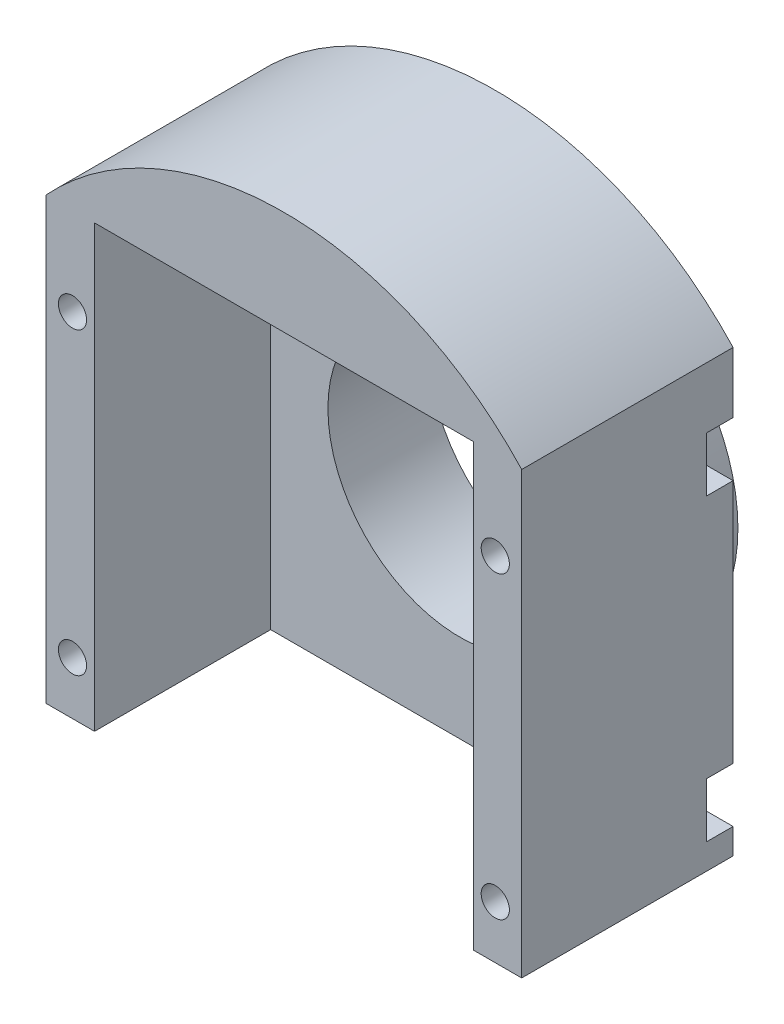
ISO-10303-21;
HEADER;
FILE_DESCRIPTION(('STEP AP214'),'2;1');
FILE_NAME('part.step','',(''),(''),'','','');
FILE_SCHEMA(('AUTOMOTIVE_DESIGN { 1 0 10303 214 1 1 1 1 }'));
ENDSEC;
DATA;
#1=APPLICATION_CONTEXT('core data for automotive mechanical design processes');
#2=APPLICATION_PROTOCOL_DEFINITION('international standard','automotive_design',2000,#1);
#3=PRODUCT_CONTEXT('',#1,'mechanical');
#4=PRODUCT('Part','Part','',(#3));
#5=PRODUCT_RELATED_PRODUCT_CATEGORY('part','',(#4));
#6=PRODUCT_DEFINITION_FORMATION('','',#4);
#7=PRODUCT_DEFINITION_CONTEXT('part definition',#1,'design');
#8=PRODUCT_DEFINITION('design','',#6,#7);
#9=PRODUCT_DEFINITION_SHAPE('','',#8);
#10=(LENGTH_UNIT() NAMED_UNIT(*) SI_UNIT(.MILLI.,.METRE.));
#11=(NAMED_UNIT(*) PLANE_ANGLE_UNIT() SI_UNIT($,.RADIAN.));
#12=(NAMED_UNIT(*) SI_UNIT($,.STERADIAN.) SOLID_ANGLE_UNIT());
#13=UNCERTAINTY_MEASURE_WITH_UNIT(LENGTH_MEASURE(1.E-05),#10,'distance_accuracy_value','');
#14=(GEOMETRIC_REPRESENTATION_CONTEXT(3) GLOBAL_UNCERTAINTY_ASSIGNED_CONTEXT((#13)) GLOBAL_UNIT_ASSIGNED_CONTEXT((#10,
#11,#12)) REPRESENTATION_CONTEXT('',''));
#15=CARTESIAN_POINT('',(0.,0.,0.));
#16=DIRECTION('',(0.,0.,1.));
#17=DIRECTION('',(1.,0.,0.));
#18=AXIS2_PLACEMENT_3D('',#15,#16,#17);
#19=CARTESIAN_POINT('',(0.,0.,0.));
#20=DIRECTION('',(0.,0.,1.));
#21=DIRECTION('',(1.,0.,0.));
#22=AXIS2_PLACEMENT_3D('',#19,#20,#21);
#23=PLANE('',#22);
#24=CARTESIAN_POINT('',(0.,0.,0.));
#25=DIRECTION('',(0.,0.,1.));
#26=DIRECTION('',(1.,0.,0.));
#27=AXIS2_PLACEMENT_3D('',#24,#25,#26);
#28=CIRCLE('',#27,21.);
#29=CARTESIAN_POINT('',(21.,0.,0.));
#30=VERTEX_POINT('',#29);
#31=EDGE_CURVE('E11',#30,#30,#28,.F.);
#32=ORIENTED_EDGE('',*,*,#31,.F.);
#33=EDGE_LOOP('',(#32));
#34=FACE_BOUND('',#33,.T.);
#35=DIRECTION('',(0.,1.,0.));
#36=VECTOR('',#35,1.);
#37=CARTESIAN_POINT('',(27.,25.,0.));
#38=LINE('',#37,#36);
#39=CARTESIAN_POINT('',(27.,18.1,0.));
#40=VERTEX_POINT('',#39);
#41=CARTESIAN_POINT('',(27.,25.,0.));
#42=VERTEX_POINT('',#41);
#43=EDGE_CURVE('E427',#40,#42,#38,.T.);
#44=ORIENTED_EDGE('',*,*,#43,.F.);
#45=DIRECTION('',(1.,0.,0.));
#46=VECTOR('',#45,1.);
#47=CARTESIAN_POINT('',(27.,18.1,0.));
#48=LINE('',#47,#46);
#49=CARTESIAN_POINT('',(24.,18.1,0.));
#50=VERTEX_POINT('',#49);
#51=EDGE_CURVE('E315',#50,#40,#48,.T.);
#52=ORIENTED_EDGE('',*,*,#51,.F.);
#53=CARTESIAN_POINT('',(24.,15.,0.));
#54=DIRECTION('',(0.,0.,-1.));
#55=DIRECTION('',(1.,0.,0.));
#56=AXIS2_PLACEMENT_3D('',#53,#54,#55);
#57=CIRCLE('',#56,3.1);
#58=CARTESIAN_POINT('',(24.,11.9,0.));
#59=VERTEX_POINT('',#58);
#60=EDGE_CURVE('E308',#59,#50,#57,.T.);
#61=ORIENTED_EDGE('',*,*,#60,.F.);
#62=DIRECTION('',(-1.,0.,0.));
#63=VECTOR('',#62,1.);
#64=CARTESIAN_POINT('',(24.,11.9,0.));
#65=LINE('',#64,#63);
#66=CARTESIAN_POINT('',(27.,11.9,0.));
#67=VERTEX_POINT('',#66);
#68=EDGE_CURVE('E311',#67,#59,#65,.T.);
#69=ORIENTED_EDGE('',*,*,#68,.F.);
#70=CARTESIAN_POINT('',(27.,-15.9,0.));
#71=VERTEX_POINT('',#70);
#72=EDGE_CURVE('E607',#71,#67,#38,.T.);
#73=ORIENTED_EDGE('',*,*,#72,.F.);
#74=DIRECTION('',(1.,0.,0.));
#75=VECTOR('',#74,1.);
#76=CARTESIAN_POINT('',(27.,-15.9,0.));
#77=LINE('',#76,#75);
#78=CARTESIAN_POINT('',(24.,-15.9,0.));
#79=VERTEX_POINT('',#78);
#80=EDGE_CURVE('E357',#79,#71,#77,.T.);
#81=ORIENTED_EDGE('',*,*,#80,.F.);
#82=CARTESIAN_POINT('',(24.,-19.,0.));
#83=DIRECTION('',(0.,0.,-1.));
#84=DIRECTION('',(1.,0.,0.));
#85=AXIS2_PLACEMENT_3D('',#82,#83,#84);
#86=CIRCLE('',#85,3.1);
#87=CARTESIAN_POINT('',(24.,-22.1,0.));
#88=VERTEX_POINT('',#87);
#89=EDGE_CURVE('E369',#88,#79,#86,.T.);
#90=ORIENTED_EDGE('',*,*,#89,.F.);
#91=DIRECTION('',(-1.,0.,0.));
#92=VECTOR('',#91,1.);
#93=CARTESIAN_POINT('',(24.,-22.1,0.));
#94=LINE('',#93,#92);
#95=CARTESIAN_POINT('',(27.,-22.1,0.));
#96=VERTEX_POINT('',#95);
#97=EDGE_CURVE('E317',#96,#88,#94,.T.);
#98=ORIENTED_EDGE('',*,*,#97,.F.);
#99=CARTESIAN_POINT('',(27.,-25.,0.));
#100=VERTEX_POINT('',#99);
#101=EDGE_CURVE('E232',#100,#96,#38,.T.);
#102=ORIENTED_EDGE('',*,*,#101,.F.);
#103=DIRECTION('',(1.,0.,0.));
#104=VECTOR('',#103,1.);
#105=CARTESIAN_POINT('',(-27.,-25.,0.));
#106=LINE('',#105,#104);
#107=CARTESIAN_POINT('',(-27.,-25.,0.));
#108=VERTEX_POINT('',#107);
#109=EDGE_CURVE('E231',#108,#100,#106,.T.);
#110=ORIENTED_EDGE('',*,*,#109,.F.);
#111=DIRECTION('',(0.,-1.,0.));
#112=VECTOR('',#111,1.);
#113=CARTESIAN_POINT('',(-27.,25.,0.));
#114=LINE('',#113,#112);
#115=CARTESIAN_POINT('',(-27.,-22.1,0.));
#116=VERTEX_POINT('',#115);
#117=EDGE_CURVE('E228',#116,#108,#114,.T.);
#118=ORIENTED_EDGE('',*,*,#117,.F.);
#119=DIRECTION('',(-1.,0.,0.));
#120=VECTOR('',#119,1.);
#121=CARTESIAN_POINT('',(-24.,-22.1,0.));
#122=LINE('',#121,#120);
#123=CARTESIAN_POINT('',(-24.,-22.1,0.));
#124=VERTEX_POINT('',#123);
#125=EDGE_CURVE('E336',#124,#116,#122,.T.);
#126=ORIENTED_EDGE('',*,*,#125,.F.);
#127=CARTESIAN_POINT('',(-24.,-19.,0.));
#128=DIRECTION('',(0.,0.,-1.));
#129=DIRECTION('',(-1.,0.,0.));
#130=AXIS2_PLACEMENT_3D('',#127,#128,#129);
#131=CIRCLE('',#130,3.1);
#132=CARTESIAN_POINT('',(-24.,-15.9,0.));
#133=VERTEX_POINT('',#132);
#134=EDGE_CURVE('E338',#133,#124,#131,.T.);
#135=ORIENTED_EDGE('',*,*,#134,.F.);
#136=DIRECTION('',(1.,0.,0.));
#137=VECTOR('',#136,1.);
#138=CARTESIAN_POINT('',(-27.,-15.9,0.));
#139=LINE('',#138,#137);
#140=CARTESIAN_POINT('',(-27.,-15.9,0.));
#141=VERTEX_POINT('',#140);
#142=EDGE_CURVE('E226',#141,#133,#139,.T.);
#143=ORIENTED_EDGE('',*,*,#142,.F.);
#144=CARTESIAN_POINT('',(-27.,11.9,0.));
#145=VERTEX_POINT('',#144);
#146=EDGE_CURVE('E220',#145,#141,#114,.T.);
#147=ORIENTED_EDGE('',*,*,#146,.F.);
#148=DIRECTION('',(-1.,0.,0.));
#149=VECTOR('',#148,1.);
#150=CARTESIAN_POINT('',(-24.,11.9,0.));
#151=LINE('',#150,#149);
#152=CARTESIAN_POINT('',(-24.,11.9,0.));
#153=VERTEX_POINT('',#152);
#154=EDGE_CURVE('E201',#153,#145,#151,.T.);
#155=ORIENTED_EDGE('',*,*,#154,.F.);
#156=CARTESIAN_POINT('',(-24.,15.,0.));
#157=DIRECTION('',(0.,0.,-1.));
#158=DIRECTION('',(-1.,0.,0.));
#159=AXIS2_PLACEMENT_3D('',#156,#157,#158);
#160=CIRCLE('',#159,3.1);
#161=CARTESIAN_POINT('',(-24.,18.1,0.));
#162=VERTEX_POINT('',#161);
#163=EDGE_CURVE('E212',#162,#153,#160,.T.);
#164=ORIENTED_EDGE('',*,*,#163,.F.);
#165=DIRECTION('',(1.,0.,0.));
#166=VECTOR('',#165,1.);
#167=CARTESIAN_POINT('',(-27.,18.1,0.));
#168=LINE('',#167,#166);
#169=CARTESIAN_POINT('',(-27.,18.1,0.));
#170=VERTEX_POINT('',#169);
#171=EDGE_CURVE('E287',#170,#162,#168,.T.);
#172=ORIENTED_EDGE('',*,*,#171,.F.);
#173=CARTESIAN_POINT('',(-27.,25.,0.));
#174=VERTEX_POINT('',#173);
#175=EDGE_CURVE('E227',#174,#170,#114,.T.);
#176=ORIENTED_EDGE('',*,*,#175,.F.);
#177=CARTESIAN_POINT('',(0.,-0.00479953928845048,0.));
#178=DIRECTION('',(0.,0.,1.));
#179=DIRECTION('',(1.,0.,0.));
#180=AXIS2_PLACEMENT_3D('',#177,#178,#179);
#181=CIRCLE('',#180,36.8);
#182=EDGE_CURVE('E410',#174,#42,#181,.F.);
#183=ORIENTED_EDGE('',*,*,#182,.T.);
#184=EDGE_LOOP('',(#44,#52,#61,#69,#73,#81,#90,#98,#102,#110,#118,#126,#135,#143,#147,#155,#164,
#172,#176,#183));
#185=FACE_BOUND('',#184,.T.);
#186=ADVANCED_FACE('F39',(#34,#185),#23,.F.);
#187=CARTESIAN_POINT('',(-24.,15.,0.));
#188=DIRECTION('',(0.,0.,1.));
#189=DIRECTION('',(1.,0.,0.));
#190=AXIS2_PLACEMENT_3D('',#187,#188,#189);
#191=CYLINDRICAL_SURFACE('',#190,1.6);
#192=CARTESIAN_POINT('',(-24.,15.,24.));
#193=DIRECTION('',(0.,0.,1.));
#194=DIRECTION('',(1.,0.,0.));
#195=AXIS2_PLACEMENT_3D('',#192,#193,#194);
#196=CIRCLE('',#195,1.6);
#197=CARTESIAN_POINT('',(-22.4,15.,24.));
#198=VERTEX_POINT('',#197);
#199=EDGE_CURVE('E419',#198,#198,#196,.T.);
#200=ORIENTED_EDGE('',*,*,#199,.T.);
#201=EDGE_LOOP('',(#200));
#202=FACE_BOUND('',#201,.T.);
#203=CARTESIAN_POINT('',(-24.,15.,3.));
#204=DIRECTION('',(0.,0.,-1.));
#205=DIRECTION('',(-1.,0.,0.));
#206=AXIS2_PLACEMENT_3D('',#203,#204,#205);
#207=CIRCLE('',#206,1.6);
#208=CARTESIAN_POINT('',(-25.6,15.,3.));
#209=VERTEX_POINT('',#208);
#210=EDGE_CURVE('E260',#209,#209,#207,.F.);
#211=ORIENTED_EDGE('',*,*,#210,.F.);
#212=EDGE_LOOP('',(#211));
#213=FACE_BOUND('',#212,.T.);
#214=ADVANCED_FACE('F477',(#202,#213),#191,.F.);
#215=CARTESIAN_POINT('',(-24.,-19.,0.));
#216=DIRECTION('',(0.,0.,1.));
#217=DIRECTION('',(1.,0.,0.));
#218=AXIS2_PLACEMENT_3D('',#215,#216,#217);
#219=CYLINDRICAL_SURFACE('',#218,1.6);
#220=CARTESIAN_POINT('',(-24.,-19.,24.));
#221=DIRECTION('',(0.,0.,1.));
#222=DIRECTION('',(1.,0.,0.));
#223=AXIS2_PLACEMENT_3D('',#220,#221,#222);
#224=CIRCLE('',#223,1.6);
#225=CARTESIAN_POINT('',(-22.4,-19.,24.));
#226=VERTEX_POINT('',#225);
#227=EDGE_CURVE('E413',#226,#226,#224,.T.);
#228=ORIENTED_EDGE('',*,*,#227,.T.);
#229=EDGE_LOOP('',(#228));
#230=FACE_BOUND('',#229,.T.);
#231=CARTESIAN_POINT('',(-24.,-19.,3.));
#232=DIRECTION('',(0.,0.,-1.));
#233=DIRECTION('',(-1.,0.,0.));
#234=AXIS2_PLACEMENT_3D('',#231,#232,#233);
#235=CIRCLE('',#234,1.6);
#236=CARTESIAN_POINT('',(-25.6,-19.,3.));
#237=VERTEX_POINT('',#236);
#238=EDGE_CURVE('E250',#237,#237,#235,.F.);
#239=ORIENTED_EDGE('',*,*,#238,.F.);
#240=EDGE_LOOP('',(#239));
#241=FACE_BOUND('',#240,.T.);
#242=ADVANCED_FACE('F483',(#230,#241),#219,.F.);
#243=CARTESIAN_POINT('',(-27.,-25.,24.));
#244=DIRECTION('',(0.,1.,0.));
#245=DIRECTION('',(0.,0.,1.));
#246=AXIS2_PLACEMENT_3D('',#243,#244,#245);
#247=PLANE('',#246);
#248=DIRECTION('',(0.,0.,1.));
#249=VECTOR('',#248,1.);
#250=CARTESIAN_POINT('',(21.5,-25.,4.));
#251=LINE('',#250,#249);
#252=CARTESIAN_POINT('',(21.5,-25.,4.));
#253=VERTEX_POINT('',#252);
#254=CARTESIAN_POINT('',(21.5,-25.,24.));
#255=VERTEX_POINT('',#254);
#256=EDGE_CURVE('E403',#253,#255,#251,.T.);
#257=ORIENTED_EDGE('',*,*,#256,.F.);
#258=DIRECTION('',(1.,0.,0.));
#259=VECTOR('',#258,1.);
#260=CARTESIAN_POINT('',(0.,-25.,4.));
#261=LINE('',#260,#259);
#262=CARTESIAN_POINT('',(-21.5,-25.,4.));
#263=VERTEX_POINT('',#262);
#264=EDGE_CURVE('E386',#263,#253,#261,.T.);
#265=ORIENTED_EDGE('',*,*,#264,.F.);
#266=DIRECTION('',(0.,0.,1.));
#267=VECTOR('',#266,1.);
#268=CARTESIAN_POINT('',(-21.5,-25.,4.));
#269=LINE('',#268,#267);
#270=CARTESIAN_POINT('',(-21.5,-25.,24.));
#271=VERTEX_POINT('',#270);
#272=EDGE_CURVE('E405',#263,#271,#269,.T.);
#273=ORIENTED_EDGE('',*,*,#272,.T.);
#274=DIRECTION('',(1.,0.,0.));
#275=VECTOR('',#274,1.);
#276=CARTESIAN_POINT('',(-27.,-25.,24.));
#277=LINE('',#276,#275);
#278=CARTESIAN_POINT('',(-27.,-25.,24.));
#279=VERTEX_POINT('',#278);
#280=EDGE_CURVE('E242',#279,#271,#277,.T.);
#281=ORIENTED_EDGE('',*,*,#280,.F.);
#282=DIRECTION('',(0.,0.,-1.));
#283=VECTOR('',#282,1.);
#284=CARTESIAN_POINT('',(-27.,-25.,24.));
#285=LINE('',#284,#283);
#286=EDGE_CURVE('E241',#279,#108,#285,.T.);
#287=ORIENTED_EDGE('',*,*,#286,.T.);
#288=ORIENTED_EDGE('',*,*,#109,.T.);
#289=DIRECTION('',(0.,0.,-1.));
#290=VECTOR('',#289,1.);
#291=CARTESIAN_POINT('',(27.,-25.,24.));
#292=LINE('',#291,#290);
#293=CARTESIAN_POINT('',(27.,-25.,24.));
#294=VERTEX_POINT('',#293);
#295=EDGE_CURVE('E238',#294,#100,#292,.T.);
#296=ORIENTED_EDGE('',*,*,#295,.F.);
#297=EDGE_CURVE('E430',#255,#294,#277,.T.);
#298=ORIENTED_EDGE('',*,*,#297,.F.);
#299=EDGE_LOOP('',(#257,#265,#273,#281,#287,#288,#296,#298));
#300=FACE_BOUND('',#299,.T.);
#301=ADVANCED_FACE('F441',(#300),#247,.F.);
#302=CARTESIAN_POINT('',(0.,0.,24.));
#303=DIRECTION('',(0.,0.,1.));
#304=DIRECTION('',(1.,0.,0.));
#305=AXIS2_PLACEMENT_3D('',#302,#303,#304);
#306=PLANE('',#305);
#307=ORIENTED_EDGE('',*,*,#227,.F.);
#308=EDGE_LOOP('',(#307));
#309=FACE_BOUND('',#308,.T.);
#310=CARTESIAN_POINT('',(24.,-19.,24.));
#311=DIRECTION('',(0.,0.,1.));
#312=DIRECTION('',(1.,0.,0.));
#313=AXIS2_PLACEMENT_3D('',#310,#311,#312);
#314=CIRCLE('',#313,1.6);
#315=CARTESIAN_POINT('',(25.6,-19.,24.));
#316=VERTEX_POINT('',#315);
#317=EDGE_CURVE('E420',#316,#316,#314,.T.);
#318=ORIENTED_EDGE('',*,*,#317,.F.);
#319=EDGE_LOOP('',(#318));
#320=FACE_BOUND('',#319,.T.);
#321=CARTESIAN_POINT('',(24.,15.,24.));
#322=DIRECTION('',(0.,0.,1.));
#323=DIRECTION('',(1.,0.,0.));
#324=AXIS2_PLACEMENT_3D('',#321,#322,#323);
#325=CIRCLE('',#324,1.6);
#326=CARTESIAN_POINT('',(25.6,15.,24.));
#327=VERTEX_POINT('',#326);
#328=EDGE_CURVE('E416',#327,#327,#325,.T.);
#329=ORIENTED_EDGE('',*,*,#328,.F.);
#330=EDGE_LOOP('',(#329));
#331=FACE_BOUND('',#330,.T.);
#332=ORIENTED_EDGE('',*,*,#199,.F.);
#333=EDGE_LOOP('',(#332));
#334=FACE_BOUND('',#333,.T.);
#335=DIRECTION('',(1.,0.,0.));
#336=VECTOR('',#335,1.);
#337=CARTESIAN_POINT('',(0.,25.,24.));
#338=LINE('',#337,#336);
#339=CARTESIAN_POINT('',(-21.5,25.,24.));
#340=VERTEX_POINT('',#339);
#341=CARTESIAN_POINT('',(21.5,25.,24.));
#342=VERTEX_POINT('',#341);
#343=EDGE_CURVE('E263',#340,#342,#338,.T.);
#344=ORIENTED_EDGE('',*,*,#343,.T.);
#345=DIRECTION('',(0.,-1.,0.));
#346=VECTOR('',#345,1.);
#347=CARTESIAN_POINT('',(21.5,0.,24.));
#348=LINE('',#347,#346);
#349=EDGE_CURVE('E384',#342,#255,#348,.T.);
#350=ORIENTED_EDGE('',*,*,#349,.T.);
#351=ORIENTED_EDGE('',*,*,#297,.T.);
#352=DIRECTION('',(0.,1.,0.));
#353=VECTOR('',#352,1.);
#354=CARTESIAN_POINT('',(27.,25.,24.));
#355=LINE('',#354,#353);
#356=CARTESIAN_POINT('',(27.,25.,24.));
#357=VERTEX_POINT('',#356);
#358=EDGE_CURVE('E237',#294,#357,#355,.T.);
#359=ORIENTED_EDGE('',*,*,#358,.T.);
#360=CARTESIAN_POINT('',(0.,-0.00479953928845048,24.));
#361=DIRECTION('',(0.,0.,1.));
#362=DIRECTION('',(-1.,0.,0.));
#363=AXIS2_PLACEMENT_3D('',#360,#361,#362);
#364=CIRCLE('',#363,36.8);
#365=CARTESIAN_POINT('',(-27.,25.,24.));
#366=VERTEX_POINT('',#365);
#367=EDGE_CURVE('E402',#357,#366,#364,.T.);
#368=ORIENTED_EDGE('',*,*,#367,.T.);
#369=DIRECTION('',(0.,-1.,0.));
#370=VECTOR('',#369,1.);
#371=CARTESIAN_POINT('',(-27.,25.,24.));
#372=LINE('',#371,#370);
#373=EDGE_CURVE('E429',#366,#279,#372,.T.);
#374=ORIENTED_EDGE('',*,*,#373,.T.);
#375=ORIENTED_EDGE('',*,*,#280,.T.);
#376=DIRECTION('',(0.,1.,0.));
#377=VECTOR('',#376,1.);
#378=CARTESIAN_POINT('',(-21.5,0.,24.));
#379=LINE('',#378,#377);
#380=EDGE_CURVE('E394',#271,#340,#379,.T.);
#381=ORIENTED_EDGE('',*,*,#380,.T.);
#382=EDGE_LOOP('',(#344,#350,#351,#359,#368,#374,#375,#381));
#383=FACE_BOUND('',#382,.T.);
#384=ADVANCED_FACE('F436',(#309,#320,#331,#334,#383),#306,.T.);
#385=CARTESIAN_POINT('',(27.,25.,24.));
#386=DIRECTION('',(-1.,0.,0.));
#387=DIRECTION('',(0.,0.,1.));
#388=AXIS2_PLACEMENT_3D('',#385,#386,#387);
#389=PLANE('',#388);
#390=DIRECTION('',(0.,-1.,0.));
#391=VECTOR('',#390,1.);
#392=CARTESIAN_POINT('',(27.,18.1,3.));
#393=LINE('',#392,#391);
#394=CARTESIAN_POINT('',(27.,18.1,3.));
#395=VERTEX_POINT('',#394);
#396=CARTESIAN_POINT('',(27.,11.9,3.));
#397=VERTEX_POINT('',#396);
#398=EDGE_CURVE('E323',#395,#397,#393,.T.);
#399=ORIENTED_EDGE('',*,*,#398,.F.);
#400=DIRECTION('',(0.,0.,-1.));
#401=VECTOR('',#400,1.);
#402=CARTESIAN_POINT('',(27.,18.1,3.));
#403=LINE('',#402,#401);
#404=EDGE_CURVE('E298',#395,#40,#403,.T.);
#405=ORIENTED_EDGE('',*,*,#404,.T.);
#406=ORIENTED_EDGE('',*,*,#43,.T.);
#407=DIRECTION('',(0.,0.,-1.));
#408=VECTOR('',#407,1.);
#409=CARTESIAN_POINT('',(27.,25.,24.));
#410=LINE('',#409,#408);
#411=EDGE_CURVE('E47',#357,#42,#410,.T.);
#412=ORIENTED_EDGE('',*,*,#411,.F.);
#413=ORIENTED_EDGE('',*,*,#358,.F.);
#414=ORIENTED_EDGE('',*,*,#295,.T.);
#415=ORIENTED_EDGE('',*,*,#101,.T.);
#416=DIRECTION('',(0.,0.,-1.));
#417=VECTOR('',#416,1.);
#418=CARTESIAN_POINT('',(27.,-22.1,3.));
#419=LINE('',#418,#417);
#420=CARTESIAN_POINT('',(27.,-22.1,3.));
#421=VERTEX_POINT('',#420);
#422=EDGE_CURVE('E366',#421,#96,#419,.T.);
#423=ORIENTED_EDGE('',*,*,#422,.F.);
#424=DIRECTION('',(0.,-1.,0.));
#425=VECTOR('',#424,1.);
#426=CARTESIAN_POINT('',(27.,-15.9,3.));
#427=LINE('',#426,#425);
#428=CARTESIAN_POINT('',(27.,-15.9,3.));
#429=VERTEX_POINT('',#428);
#430=EDGE_CURVE('E353',#429,#421,#427,.T.);
#431=ORIENTED_EDGE('',*,*,#430,.F.);
#432=DIRECTION('',(0.,0.,-1.));
#433=VECTOR('',#432,1.);
#434=CARTESIAN_POINT('',(27.,-15.9,3.));
#435=LINE('',#434,#433);
#436=EDGE_CURVE('E254',#429,#71,#435,.T.);
#437=ORIENTED_EDGE('',*,*,#436,.T.);
#438=ORIENTED_EDGE('',*,*,#72,.T.);
#439=DIRECTION('',(0.,0.,-1.));
#440=VECTOR('',#439,1.);
#441=CARTESIAN_POINT('',(27.,11.9,3.));
#442=LINE('',#441,#440);
#443=EDGE_CURVE('E302',#397,#67,#442,.T.);
#444=ORIENTED_EDGE('',*,*,#443,.F.);
#445=EDGE_LOOP('',(#399,#405,#406,#412,#413,#414,#415,#423,#431,#437,#438,#444));
#446=FACE_BOUND('',#445,.T.);
#447=ADVANCED_FACE('F41',(#446),#389,.F.);
#448=CARTESIAN_POINT('',(-27.,25.,24.));
#449=DIRECTION('',(1.,0.,0.));
#450=DIRECTION('',(0.,0.,-1.));
#451=AXIS2_PLACEMENT_3D('',#448,#449,#450);
#452=PLANE('',#451);
#453=DIRECTION('',(0.,1.,0.));
#454=VECTOR('',#453,1.);
#455=CARTESIAN_POINT('',(-27.,-15.9,3.));
#456=LINE('',#455,#454);
#457=CARTESIAN_POINT('',(-27.,-22.1,3.));
#458=VERTEX_POINT('',#457);
#459=CARTESIAN_POINT('',(-27.,-15.9,3.));
#460=VERTEX_POINT('',#459);
#461=EDGE_CURVE('E339',#458,#460,#456,.T.);
#462=ORIENTED_EDGE('',*,*,#461,.F.);
#463=DIRECTION('',(0.,0.,-1.));
#464=VECTOR('',#463,1.);
#465=CARTESIAN_POINT('',(-27.,-22.1,3.));
#466=LINE('',#465,#464);
#467=EDGE_CURVE('E289',#458,#116,#466,.T.);
#468=ORIENTED_EDGE('',*,*,#467,.T.);
#469=ORIENTED_EDGE('',*,*,#117,.T.);
#470=ORIENTED_EDGE('',*,*,#286,.F.);
#471=ORIENTED_EDGE('',*,*,#373,.F.);
#472=DIRECTION('',(0.,0.,-1.));
#473=VECTOR('',#472,1.);
#474=CARTESIAN_POINT('',(-27.,25.,24.));
#475=LINE('',#474,#473);
#476=EDGE_CURVE('E245',#366,#174,#475,.T.);
#477=ORIENTED_EDGE('',*,*,#476,.T.);
#478=ORIENTED_EDGE('',*,*,#175,.T.);
#479=DIRECTION('',(0.,0.,-1.));
#480=VECTOR('',#479,1.);
#481=CARTESIAN_POINT('',(-27.,18.1,3.));
#482=LINE('',#481,#480);
#483=CARTESIAN_POINT('',(-27.,18.1,3.));
#484=VERTEX_POINT('',#483);
#485=EDGE_CURVE('E62',#484,#170,#482,.T.);
#486=ORIENTED_EDGE('',*,*,#485,.F.);
#487=DIRECTION('',(0.,1.,0.));
#488=VECTOR('',#487,1.);
#489=CARTESIAN_POINT('',(-27.,18.1,3.));
#490=LINE('',#489,#488);
#491=CARTESIAN_POINT('',(-27.,11.9,3.));
#492=VERTEX_POINT('',#491);
#493=EDGE_CURVE('E213',#492,#484,#490,.T.);
#494=ORIENTED_EDGE('',*,*,#493,.F.);
#495=DIRECTION('',(0.,0.,-1.));
#496=VECTOR('',#495,1.);
#497=CARTESIAN_POINT('',(-27.,11.9,3.));
#498=LINE('',#497,#496);
#499=EDGE_CURVE('E205',#492,#145,#498,.T.);
#500=ORIENTED_EDGE('',*,*,#499,.T.);
#501=ORIENTED_EDGE('',*,*,#146,.T.);
#502=DIRECTION('',(0.,0.,-1.));
#503=VECTOR('',#502,1.);
#504=CARTESIAN_POINT('',(-27.,-15.9,3.));
#505=LINE('',#504,#503);
#506=EDGE_CURVE('E54',#460,#141,#505,.T.);
#507=ORIENTED_EDGE('',*,*,#506,.F.);
#508=EDGE_LOOP('',(#462,#468,#469,#470,#471,#477,#478,#486,#494,#500,#501,#507));
#509=FACE_BOUND('',#508,.T.);
#510=ADVANCED_FACE('F219',(#509),#452,.F.);
#511=CARTESIAN_POINT('',(24.,15.,0.));
#512=DIRECTION('',(0.,0.,1.));
#513=DIRECTION('',(1.,0.,0.));
#514=AXIS2_PLACEMENT_3D('',#511,#512,#513);
#515=CYLINDRICAL_SURFACE('',#514,1.6);
#516=CARTESIAN_POINT('',(24.,15.,3.));
#517=DIRECTION('',(0.,0.,1.));
#518=DIRECTION('',(1.,0.,0.));
#519=AXIS2_PLACEMENT_3D('',#516,#517,#518);
#520=CIRCLE('',#519,1.6);
#521=CARTESIAN_POINT('',(25.6,15.,3.));
#522=VERTEX_POINT('',#521);
#523=EDGE_CURVE('E257',#522,#522,#520,.F.);
#524=ORIENTED_EDGE('',*,*,#523,.T.);
#525=EDGE_LOOP('',(#524));
#526=FACE_BOUND('',#525,.T.);
#527=ORIENTED_EDGE('',*,*,#328,.T.);
#528=EDGE_LOOP('',(#527));
#529=FACE_BOUND('',#528,.T.);
#530=ADVANCED_FACE('F491',(#526,#529),#515,.F.);
#531=CARTESIAN_POINT('',(24.,-19.,0.));
#532=DIRECTION('',(0.,0.,1.));
#533=DIRECTION('',(1.,0.,0.));
#534=AXIS2_PLACEMENT_3D('',#531,#532,#533);
#535=CYLINDRICAL_SURFACE('',#534,1.6);
#536=CARTESIAN_POINT('',(24.,-19.,3.));
#537=DIRECTION('',(0.,0.,1.));
#538=DIRECTION('',(1.,0.,0.));
#539=AXIS2_PLACEMENT_3D('',#536,#537,#538);
#540=CIRCLE('',#539,1.6);
#541=CARTESIAN_POINT('',(25.6,-19.,3.));
#542=VERTEX_POINT('',#541);
#543=EDGE_CURVE('E253',#542,#542,#540,.F.);
#544=ORIENTED_EDGE('',*,*,#543,.T.);
#545=EDGE_LOOP('',(#544));
#546=FACE_BOUND('',#545,.T.);
#547=ORIENTED_EDGE('',*,*,#317,.T.);
#548=EDGE_LOOP('',(#547));
#549=FACE_BOUND('',#548,.T.);
#550=ADVANCED_FACE('F496',(#546,#549),#535,.F.);
#551=CARTESIAN_POINT('',(0.,-0.00479953928845048,-55.2732010463332));
#552=DIRECTION('',(0.,0.,1.));
#553=DIRECTION('',(1.,0.,0.));
#554=AXIS2_PLACEMENT_3D('',#551,#552,#553);
#555=CYLINDRICAL_SURFACE('',#554,36.8);
#556=ORIENTED_EDGE('',*,*,#182,.F.);
#557=ORIENTED_EDGE('',*,*,#476,.F.);
#558=ORIENTED_EDGE('',*,*,#367,.F.);
#559=ORIENTED_EDGE('',*,*,#411,.T.);
#560=EDGE_LOOP('',(#556,#557,#558,#559));
#561=FACE_BOUND('',#560,.T.);
#562=ADVANCED_FACE('F451',(#561),#555,.T.);
#563=CARTESIAN_POINT('',(0.,25.,4.));
#564=DIRECTION('',(0.,-1.,0.));
#565=DIRECTION('',(1.,0.,0.));
#566=AXIS2_PLACEMENT_3D('',#563,#564,#565);
#567=PLANE('',#566);
#568=ORIENTED_EDGE('',*,*,#343,.F.);
#569=DIRECTION('',(0.,0.,1.));
#570=VECTOR('',#569,1.);
#571=CARTESIAN_POINT('',(-21.5,25.,4.));
#572=LINE('',#571,#570);
#573=CARTESIAN_POINT('',(-21.5,25.,4.));
#574=VERTEX_POINT('',#573);
#575=EDGE_CURVE('E391',#574,#340,#572,.T.);
#576=ORIENTED_EDGE('',*,*,#575,.F.);
#577=DIRECTION('',(1.,0.,0.));
#578=VECTOR('',#577,1.);
#579=CARTESIAN_POINT('',(0.,25.,4.));
#580=LINE('',#579,#578);
#581=CARTESIAN_POINT('',(21.5,25.,4.));
#582=VERTEX_POINT('',#581);
#583=EDGE_CURVE('E380',#574,#582,#580,.T.);
#584=ORIENTED_EDGE('',*,*,#583,.T.);
#585=DIRECTION('',(0.,0.,1.));
#586=VECTOR('',#585,1.);
#587=CARTESIAN_POINT('',(21.5,25.,4.));
#588=LINE('',#587,#586);
#589=EDGE_CURVE('E399',#582,#342,#588,.T.);
#590=ORIENTED_EDGE('',*,*,#589,.T.);
#591=EDGE_LOOP('',(#568,#576,#584,#590));
#592=FACE_BOUND('',#591,.T.);
#593=ADVANCED_FACE('F464',(#592),#567,.T.);
#594=CARTESIAN_POINT('',(21.5,0.,4.));
#595=DIRECTION('',(-1.,0.,0.));
#596=DIRECTION('',(0.,-1.,0.));
#597=AXIS2_PLACEMENT_3D('',#594,#595,#596);
#598=PLANE('',#597);
#599=ORIENTED_EDGE('',*,*,#349,.F.);
#600=ORIENTED_EDGE('',*,*,#589,.F.);
#601=DIRECTION('',(0.,-1.,0.));
#602=VECTOR('',#601,1.);
#603=CARTESIAN_POINT('',(21.5,0.,4.));
#604=LINE('',#603,#602);
#605=EDGE_CURVE('E389',#582,#253,#604,.T.);
#606=ORIENTED_EDGE('',*,*,#605,.T.);
#607=ORIENTED_EDGE('',*,*,#256,.T.);
#608=EDGE_LOOP('',(#599,#600,#606,#607));
#609=FACE_BOUND('',#608,.T.);
#610=ADVANCED_FACE('F466',(#609),#598,.T.);
#611=CARTESIAN_POINT('',(-21.5,0.,4.));
#612=DIRECTION('',(1.,0.,0.));
#613=DIRECTION('',(0.,1.,0.));
#614=AXIS2_PLACEMENT_3D('',#611,#612,#613);
#615=PLANE('',#614);
#616=ORIENTED_EDGE('',*,*,#380,.F.);
#617=ORIENTED_EDGE('',*,*,#272,.F.);
#618=DIRECTION('',(0.,1.,0.));
#619=VECTOR('',#618,1.);
#620=CARTESIAN_POINT('',(-21.5,0.,4.));
#621=LINE('',#620,#619);
#622=EDGE_CURVE('E383',#263,#574,#621,.T.);
#623=ORIENTED_EDGE('',*,*,#622,.T.);
#624=ORIENTED_EDGE('',*,*,#575,.T.);
#625=EDGE_LOOP('',(#616,#617,#623,#624));
#626=FACE_BOUND('',#625,.T.);
#627=ADVANCED_FACE('F457',(#626),#615,.T.);
#628=CARTESIAN_POINT('',(0.,0.,4.));
#629=DIRECTION('',(0.,0.,1.));
#630=DIRECTION('',(1.,0.,0.));
#631=AXIS2_PLACEMENT_3D('',#628,#629,#630);
#632=PLANE('',#631);
#633=CARTESIAN_POINT('',(0.,0.,4.));
#634=DIRECTION('',(0.,0.,1.));
#635=DIRECTION('',(1.,0.,0.));
#636=AXIS2_PLACEMENT_3D('',#633,#634,#635);
#637=CIRCLE('',#636,15.);
#638=CARTESIAN_POINT('',(15.,0.,4.));
#639=VERTEX_POINT('',#638);
#640=EDGE_CURVE('E222',#639,#639,#637,.T.);
#641=ORIENTED_EDGE('',*,*,#640,.F.);
#642=EDGE_LOOP('',(#641));
#643=FACE_BOUND('',#642,.T.);
#644=ORIENTED_EDGE('',*,*,#583,.F.);
#645=ORIENTED_EDGE('',*,*,#622,.F.);
#646=ORIENTED_EDGE('',*,*,#264,.T.);
#647=ORIENTED_EDGE('',*,*,#605,.F.);
#648=EDGE_LOOP('',(#644,#645,#646,#647));
#649=FACE_BOUND('',#648,.T.);
#650=ADVANCED_FACE('F461',(#643,#649),#632,.T.);
#651=CARTESIAN_POINT('',(-24.,-19.,3.));
#652=DIRECTION('',(0.,0.,-1.));
#653=DIRECTION('',(-1.,0.,0.));
#654=AXIS2_PLACEMENT_3D('',#651,#652,#653);
#655=PLANE('',#654);
#656=ORIENTED_EDGE('',*,*,#461,.T.);
#657=DIRECTION('',(1.,0.,0.));
#658=VECTOR('',#657,1.);
#659=CARTESIAN_POINT('',(-27.,-15.9,3.));
#660=LINE('',#659,#658);
#661=CARTESIAN_POINT('',(-24.,-15.9,3.));
#662=VERTEX_POINT('',#661);
#663=EDGE_CURVE('E348',#460,#662,#660,.T.);
#664=ORIENTED_EDGE('',*,*,#663,.T.);
#665=CARTESIAN_POINT('',(-24.,-19.,3.));
#666=DIRECTION('',(0.,0.,-1.));
#667=DIRECTION('',(-1.,0.,0.));
#668=AXIS2_PLACEMENT_3D('',#665,#666,#667);
#669=CIRCLE('',#668,3.1);
#670=CARTESIAN_POINT('',(-24.,-22.1,3.));
#671=VERTEX_POINT('',#670);
#672=EDGE_CURVE('E345',#662,#671,#669,.T.);
#673=ORIENTED_EDGE('',*,*,#672,.T.);
#674=DIRECTION('',(-1.,0.,0.));
#675=VECTOR('',#674,1.);
#676=CARTESIAN_POINT('',(-24.,-22.1,3.));
#677=LINE('',#676,#675);
#678=EDGE_CURVE('E329',#671,#458,#677,.T.);
#679=ORIENTED_EDGE('',*,*,#678,.T.);
#680=EDGE_LOOP('',(#656,#664,#673,#679));
#681=FACE_BOUND('',#680,.T.);
#682=ORIENTED_EDGE('',*,*,#238,.T.);
#683=EDGE_LOOP('',(#682));
#684=FACE_BOUND('',#683,.T.);
#685=ADVANCED_FACE('F554',(#681,#684),#655,.T.);
#686=CARTESIAN_POINT('',(-24.,-22.1,3.));
#687=DIRECTION('',(0.,-1.,0.));
#688=DIRECTION('',(0.,0.,-1.));
#689=AXIS2_PLACEMENT_3D('',#686,#687,#688);
#690=PLANE('',#689);
#691=ORIENTED_EDGE('',*,*,#125,.T.);
#692=ORIENTED_EDGE('',*,*,#467,.F.);
#693=ORIENTED_EDGE('',*,*,#678,.F.);
#694=DIRECTION('',(0.,0.,-1.));
#695=VECTOR('',#694,1.);
#696=CARTESIAN_POINT('',(-24.,-22.1,3.));
#697=LINE('',#696,#695);
#698=EDGE_CURVE('E332',#671,#124,#697,.T.);
#699=ORIENTED_EDGE('',*,*,#698,.T.);
#700=EDGE_LOOP('',(#691,#692,#693,#699));
#701=FACE_BOUND('',#700,.T.);
#702=ADVANCED_FACE('F550',(#701),#690,.F.);
#703=CARTESIAN_POINT('',(-24.,-19.,3.));
#704=DIRECTION('',(0.,0.,-1.));
#705=DIRECTION('',(-1.,0.,0.));
#706=AXIS2_PLACEMENT_3D('',#703,#704,#705);
#707=CYLINDRICAL_SURFACE('',#706,3.1);
#708=ORIENTED_EDGE('',*,*,#134,.T.);
#709=ORIENTED_EDGE('',*,*,#698,.F.);
#710=ORIENTED_EDGE('',*,*,#672,.F.);
#711=DIRECTION('',(0.,0.,-1.));
#712=VECTOR('',#711,1.);
#713=CARTESIAN_POINT('',(-24.,-15.9,3.));
#714=LINE('',#713,#712);
#715=EDGE_CURVE('E330',#662,#133,#714,.T.);
#716=ORIENTED_EDGE('',*,*,#715,.T.);
#717=EDGE_LOOP('',(#708,#709,#710,#716));
#718=FACE_BOUND('',#717,.T.);
#719=ADVANCED_FACE('F547',(#718),#707,.F.);
#720=CARTESIAN_POINT('',(-27.,-15.9,3.));
#721=DIRECTION('',(0.,1.,0.));
#722=DIRECTION('',(0.,0.,1.));
#723=AXIS2_PLACEMENT_3D('',#720,#721,#722);
#724=PLANE('',#723);
#725=ORIENTED_EDGE('',*,*,#142,.T.);
#726=ORIENTED_EDGE('',*,*,#715,.F.);
#727=ORIENTED_EDGE('',*,*,#663,.F.);
#728=ORIENTED_EDGE('',*,*,#506,.T.);
#729=EDGE_LOOP('',(#725,#726,#727,#728));
#730=FACE_BOUND('',#729,.T.);
#731=ADVANCED_FACE('F543',(#730),#724,.F.);
#732=CARTESIAN_POINT('',(24.,-19.,3.));
#733=DIRECTION('',(0.,0.,1.));
#734=DIRECTION('',(1.,0.,0.));
#735=AXIS2_PLACEMENT_3D('',#732,#733,#734);
#736=PLANE('',#735);
#737=ORIENTED_EDGE('',*,*,#430,.T.);
#738=DIRECTION('',(-1.,0.,0.));
#739=VECTOR('',#738,1.);
#740=CARTESIAN_POINT('',(24.,-22.1,3.));
#741=LINE('',#740,#739);
#742=CARTESIAN_POINT('',(24.,-22.1,3.));
#743=VERTEX_POINT('',#742);
#744=EDGE_CURVE('E356',#421,#743,#741,.T.);
#745=ORIENTED_EDGE('',*,*,#744,.T.);
#746=CARTESIAN_POINT('',(24.,-19.,3.));
#747=DIRECTION('',(0.,0.,-1.));
#748=DIRECTION('',(1.,0.,0.));
#749=AXIS2_PLACEMENT_3D('',#746,#747,#748);
#750=CIRCLE('',#749,3.1);
#751=CARTESIAN_POINT('',(24.,-15.9,3.));
#752=VERTEX_POINT('',#751);
#753=EDGE_CURVE('E360',#743,#752,#750,.T.);
#754=ORIENTED_EDGE('',*,*,#753,.T.);
#755=DIRECTION('',(1.,0.,0.));
#756=VECTOR('',#755,1.);
#757=CARTESIAN_POINT('',(27.,-15.9,3.));
#758=LINE('',#757,#756);
#759=EDGE_CURVE('E363',#752,#429,#758,.T.);
#760=ORIENTED_EDGE('',*,*,#759,.T.);
#761=EDGE_LOOP('',(#737,#745,#754,#760));
#762=FACE_BOUND('',#761,.T.);
#763=ORIENTED_EDGE('',*,*,#543,.F.);
#764=EDGE_LOOP('',(#763));
#765=FACE_BOUND('',#764,.T.);
#766=ADVANCED_FACE('F546',(#762,#765),#736,.F.);
#767=CARTESIAN_POINT('',(27.,-15.9,3.));
#768=DIRECTION('',(0.,1.,0.));
#769=DIRECTION('',(0.,0.,1.));
#770=AXIS2_PLACEMENT_3D('',#767,#768,#769);
#771=PLANE('',#770);
#772=ORIENTED_EDGE('',*,*,#80,.T.);
#773=ORIENTED_EDGE('',*,*,#436,.F.);
#774=ORIENTED_EDGE('',*,*,#759,.F.);
#775=DIRECTION('',(0.,0.,-1.));
#776=VECTOR('',#775,1.);
#777=CARTESIAN_POINT('',(24.,-15.9,3.));
#778=LINE('',#777,#776);
#779=EDGE_CURVE('E375',#752,#79,#778,.T.);
#780=ORIENTED_EDGE('',*,*,#779,.T.);
#781=EDGE_LOOP('',(#772,#773,#774,#780));
#782=FACE_BOUND('',#781,.T.);
#783=ADVANCED_FACE('F561',(#782),#771,.F.);
#784=CARTESIAN_POINT('',(24.,-19.,3.));
#785=DIRECTION('',(0.,0.,-1.));
#786=DIRECTION('',(-1.,0.,0.));
#787=AXIS2_PLACEMENT_3D('',#784,#785,#786);
#788=CYLINDRICAL_SURFACE('',#787,3.1);
#789=ORIENTED_EDGE('',*,*,#89,.T.);
#790=ORIENTED_EDGE('',*,*,#779,.F.);
#791=ORIENTED_EDGE('',*,*,#753,.F.);
#792=DIRECTION('',(0.,0.,-1.));
#793=VECTOR('',#792,1.);
#794=CARTESIAN_POINT('',(24.,-22.1,3.));
#795=LINE('',#794,#793);
#796=EDGE_CURVE('E377',#743,#88,#795,.T.);
#797=ORIENTED_EDGE('',*,*,#796,.T.);
#798=EDGE_LOOP('',(#789,#790,#791,#797));
#799=FACE_BOUND('',#798,.T.);
#800=ADVANCED_FACE('F565',(#799),#788,.F.);
#801=CARTESIAN_POINT('',(24.,-22.1,3.));
#802=DIRECTION('',(0.,-1.,0.));
#803=DIRECTION('',(0.,0.,-1.));
#804=AXIS2_PLACEMENT_3D('',#801,#802,#803);
#805=PLANE('',#804);
#806=ORIENTED_EDGE('',*,*,#97,.T.);
#807=ORIENTED_EDGE('',*,*,#796,.F.);
#808=ORIENTED_EDGE('',*,*,#744,.F.);
#809=ORIENTED_EDGE('',*,*,#422,.T.);
#810=EDGE_LOOP('',(#806,#807,#808,#809));
#811=FACE_BOUND('',#810,.T.);
#812=ADVANCED_FACE('F541',(#811),#805,.F.);
#813=CARTESIAN_POINT('',(24.,15.,3.));
#814=DIRECTION('',(0.,0.,1.));
#815=DIRECTION('',(1.,0.,0.));
#816=AXIS2_PLACEMENT_3D('',#813,#814,#815);
#817=PLANE('',#816);
#818=DIRECTION('',(1.,0.,0.));
#819=VECTOR('',#818,1.);
#820=CARTESIAN_POINT('',(27.,18.1,3.));
#821=LINE('',#820,#819);
#822=CARTESIAN_POINT('',(24.,18.1,3.));
#823=VERTEX_POINT('',#822);
#824=EDGE_CURVE('E312',#823,#395,#821,.T.);
#825=ORIENTED_EDGE('',*,*,#824,.T.);
#826=ORIENTED_EDGE('',*,*,#398,.T.);
#827=DIRECTION('',(-1.,0.,0.));
#828=VECTOR('',#827,1.);
#829=CARTESIAN_POINT('',(24.,11.9,3.));
#830=LINE('',#829,#828);
#831=CARTESIAN_POINT('',(24.,11.9,3.));
#832=VERTEX_POINT('',#831);
#833=EDGE_CURVE('E320',#397,#832,#830,.T.);
#834=ORIENTED_EDGE('',*,*,#833,.T.);
#835=CARTESIAN_POINT('',(24.,15.,3.));
#836=DIRECTION('',(0.,0.,-1.));
#837=DIRECTION('',(1.,0.,0.));
#838=AXIS2_PLACEMENT_3D('',#835,#836,#837);
#839=CIRCLE('',#838,3.1);
#840=EDGE_CURVE('E301',#832,#823,#839,.T.);
#841=ORIENTED_EDGE('',*,*,#840,.T.);
#842=EDGE_LOOP('',(#825,#826,#834,#841));
#843=FACE_BOUND('',#842,.T.);
#844=ORIENTED_EDGE('',*,*,#523,.F.);
#845=EDGE_LOOP('',(#844));
#846=FACE_BOUND('',#845,.T.);
#847=ADVANCED_FACE('F533',(#843,#846),#817,.F.);
#848=CARTESIAN_POINT('',(27.,18.1,3.));
#849=DIRECTION('',(0.,1.,0.));
#850=DIRECTION('',(0.,0.,1.));
#851=AXIS2_PLACEMENT_3D('',#848,#849,#850);
#852=PLANE('',#851);
#853=ORIENTED_EDGE('',*,*,#51,.T.);
#854=ORIENTED_EDGE('',*,*,#404,.F.);
#855=ORIENTED_EDGE('',*,*,#824,.F.);
#856=DIRECTION('',(0.,0.,-1.));
#857=VECTOR('',#856,1.);
#858=CARTESIAN_POINT('',(24.,18.1,3.));
#859=LINE('',#858,#857);
#860=EDGE_CURVE('E306',#823,#50,#859,.T.);
#861=ORIENTED_EDGE('',*,*,#860,.T.);
#862=EDGE_LOOP('',(#853,#854,#855,#861));
#863=FACE_BOUND('',#862,.T.);
#864=ADVANCED_FACE('F531',(#863),#852,.F.);
#865=CARTESIAN_POINT('',(24.,15.,3.));
#866=DIRECTION('',(0.,0.,-1.));
#867=DIRECTION('',(-1.,0.,0.));
#868=AXIS2_PLACEMENT_3D('',#865,#866,#867);
#869=CYLINDRICAL_SURFACE('',#868,3.1);
#870=ORIENTED_EDGE('',*,*,#60,.T.);
#871=ORIENTED_EDGE('',*,*,#860,.F.);
#872=ORIENTED_EDGE('',*,*,#840,.F.);
#873=DIRECTION('',(0.,0.,-1.));
#874=VECTOR('',#873,1.);
#875=CARTESIAN_POINT('',(24.,11.9,3.));
#876=LINE('',#875,#874);
#877=EDGE_CURVE('E304',#832,#59,#876,.T.);
#878=ORIENTED_EDGE('',*,*,#877,.T.);
#879=EDGE_LOOP('',(#870,#871,#872,#878));
#880=FACE_BOUND('',#879,.T.);
#881=ADVANCED_FACE('F526',(#880),#869,.F.);
#882=CARTESIAN_POINT('',(24.,11.9,3.));
#883=DIRECTION('',(0.,-1.,0.));
#884=DIRECTION('',(0.,0.,-1.));
#885=AXIS2_PLACEMENT_3D('',#882,#883,#884);
#886=PLANE('',#885);
#887=ORIENTED_EDGE('',*,*,#68,.T.);
#888=ORIENTED_EDGE('',*,*,#877,.F.);
#889=ORIENTED_EDGE('',*,*,#833,.F.);
#890=ORIENTED_EDGE('',*,*,#443,.T.);
#891=EDGE_LOOP('',(#887,#888,#889,#890));
#892=FACE_BOUND('',#891,.T.);
#893=ADVANCED_FACE('F517',(#892),#886,.F.);
#894=CARTESIAN_POINT('',(-24.,15.,3.));
#895=DIRECTION('',(0.,0.,-1.));
#896=DIRECTION('',(-1.,0.,0.));
#897=AXIS2_PLACEMENT_3D('',#894,#895,#896);
#898=PLANE('',#897);
#899=ORIENTED_EDGE('',*,*,#493,.T.);
#900=DIRECTION('',(1.,0.,0.));
#901=VECTOR('',#900,1.);
#902=CARTESIAN_POINT('',(-27.,18.1,3.));
#903=LINE('',#902,#901);
#904=CARTESIAN_POINT('',(-24.,18.1,3.));
#905=VERTEX_POINT('',#904);
#906=EDGE_CURVE('E294',#484,#905,#903,.T.);
#907=ORIENTED_EDGE('',*,*,#906,.T.);
#908=CARTESIAN_POINT('',(-24.,15.,3.));
#909=DIRECTION('',(0.,0.,-1.));
#910=DIRECTION('',(-1.,0.,0.));
#911=AXIS2_PLACEMENT_3D('',#908,#909,#910);
#912=CIRCLE('',#911,3.1);
#913=CARTESIAN_POINT('',(-24.,11.9,3.));
#914=VERTEX_POINT('',#913);
#915=EDGE_CURVE('E291',#905,#914,#912,.T.);
#916=ORIENTED_EDGE('',*,*,#915,.T.);
#917=DIRECTION('',(-1.,0.,0.));
#918=VECTOR('',#917,1.);
#919=CARTESIAN_POINT('',(-24.,11.9,3.));
#920=LINE('',#919,#918);
#921=EDGE_CURVE('E282',#914,#492,#920,.T.);
#922=ORIENTED_EDGE('',*,*,#921,.T.);
#923=EDGE_LOOP('',(#899,#907,#916,#922));
#924=FACE_BOUND('',#923,.T.);
#925=ORIENTED_EDGE('',*,*,#210,.T.);
#926=EDGE_LOOP('',(#925));
#927=FACE_BOUND('',#926,.T.);
#928=ADVANCED_FACE('F515',(#924,#927),#898,.T.);
#929=CARTESIAN_POINT('',(-24.,11.9,3.));
#930=DIRECTION('',(0.,-1.,0.));
#931=DIRECTION('',(1.,0.,0.));
#932=AXIS2_PLACEMENT_3D('',#929,#930,#931);
#933=PLANE('',#932);
#934=ORIENTED_EDGE('',*,*,#154,.T.);
#935=ORIENTED_EDGE('',*,*,#499,.F.);
#936=ORIENTED_EDGE('',*,*,#921,.F.);
#937=DIRECTION('',(0.,0.,-1.));
#938=VECTOR('',#937,1.);
#939=CARTESIAN_POINT('',(-24.,11.9,3.));
#940=LINE('',#939,#938);
#941=EDGE_CURVE('E207',#914,#153,#940,.T.);
#942=ORIENTED_EDGE('',*,*,#941,.T.);
#943=EDGE_LOOP('',(#934,#935,#936,#942));
#944=FACE_BOUND('',#943,.T.);
#945=ADVANCED_FACE('F203',(#944),#933,.F.);
#946=CARTESIAN_POINT('',(-24.,15.,3.));
#947=DIRECTION('',(0.,0.,-1.));
#948=DIRECTION('',(-1.,0.,0.));
#949=AXIS2_PLACEMENT_3D('',#946,#947,#948);
#950=CYLINDRICAL_SURFACE('',#949,3.1);
#951=ORIENTED_EDGE('',*,*,#163,.T.);
#952=ORIENTED_EDGE('',*,*,#941,.F.);
#953=ORIENTED_EDGE('',*,*,#915,.F.);
#954=DIRECTION('',(0.,0.,-1.));
#955=VECTOR('',#954,1.);
#956=CARTESIAN_POINT('',(-24.,18.1,3.));
#957=LINE('',#956,#955);
#958=EDGE_CURVE('E283',#905,#162,#957,.T.);
#959=ORIENTED_EDGE('',*,*,#958,.T.);
#960=EDGE_LOOP('',(#951,#952,#953,#959));
#961=FACE_BOUND('',#960,.T.);
#962=ADVANCED_FACE('F524',(#961),#950,.F.);
#963=CARTESIAN_POINT('',(-27.,18.1,3.));
#964=DIRECTION('',(0.,1.,0.));
#965=DIRECTION('',(0.,0.,1.));
#966=AXIS2_PLACEMENT_3D('',#963,#964,#965);
#967=PLANE('',#966);
#968=ORIENTED_EDGE('',*,*,#171,.T.);
#969=ORIENTED_EDGE('',*,*,#958,.F.);
#970=ORIENTED_EDGE('',*,*,#906,.F.);
#971=ORIENTED_EDGE('',*,*,#485,.T.);
#972=EDGE_LOOP('',(#968,#969,#970,#971));
#973=FACE_BOUND('',#972,.T.);
#974=ADVANCED_FACE('F582',(#973),#967,.F.);
#975=CARTESIAN_POINT('',(0.,0.,24.));
#976=DIRECTION('',(0.,0.,-1.));
#977=DIRECTION('',(-1.,0.,0.));
#978=AXIS2_PLACEMENT_3D('',#975,#976,#977);
#979=CYLINDRICAL_SURFACE('',#978,15.);
#980=ORIENTED_EDGE('',*,*,#640,.T.);
#981=EDGE_LOOP('',(#980));
#982=FACE_BOUND('',#981,.T.);
#983=CARTESIAN_POINT('',(0.,0.,-7.5));
#984=DIRECTION('',(0.,0.,-1.));
#985=DIRECTION('',(-1.,0.,0.));
#986=AXIS2_PLACEMENT_3D('',#983,#984,#985);
#987=CIRCLE('',#986,15.);
#988=CARTESIAN_POINT('',(-15.,0.,-7.5));
#989=VERTEX_POINT('',#988);
#990=EDGE_CURVE('E268',#989,#989,#987,.T.);
#991=ORIENTED_EDGE('',*,*,#990,.T.);
#992=EDGE_LOOP('',(#991));
#993=FACE_BOUND('',#992,.T.);
#994=ADVANCED_FACE('F578',(#982,#993),#979,.F.);
#995=CARTESIAN_POINT('',(0.,0.,-7.5));
#996=DIRECTION('',(0.,0.,-1.));
#997=DIRECTION('',(-1.,0.,0.));
#998=AXIS2_PLACEMENT_3D('',#995,#996,#997);
#999=PLANE('',#998);
#1000=CARTESIAN_POINT('',(0.,0.,-7.5));
#1001=DIRECTION('',(0.,0.,-1.));
#1002=DIRECTION('',(-1.,0.,0.));
#1003=AXIS2_PLACEMENT_3D('',#1000,#1001,#1002);
#1004=CIRCLE('',#1003,20.05);
#1005=CARTESIAN_POINT('',(-20.05,0.,-7.5));
#1006=VERTEX_POINT('',#1005);
#1007=EDGE_CURVE('E265',#1006,#1006,#1004,.T.);
#1008=ORIENTED_EDGE('',*,*,#1007,.T.);
#1009=EDGE_LOOP('',(#1008));
#1010=FACE_BOUND('',#1009,.T.);
#1011=ORIENTED_EDGE('',*,*,#990,.F.);
#1012=EDGE_LOOP('',(#1011));
#1013=FACE_BOUND('',#1012,.T.);
#1014=ADVANCED_FACE('F581',(#1010,#1013),#999,.T.);
#1015=CARTESIAN_POINT('',(0.,0.,-7.5));
#1016=DIRECTION('',(0.,0.,1.));
#1017=DIRECTION('',(1.,0.,0.));
#1018=AXIS2_PLACEMENT_3D('',#1015,#1016,#1017);
#1019=CYLINDRICAL_SURFACE('',#1018,20.05);
#1020=CARTESIAN_POINT('',(0.,0.,-0.5));
#1021=DIRECTION('',(0.,0.,-1.));
#1022=DIRECTION('',(-1.,0.,0.));
#1023=AXIS2_PLACEMENT_3D('',#1020,#1021,#1022);
#1024=CIRCLE('',#1023,20.05);
#1025=CARTESIAN_POINT('',(-20.05,0.,-0.5));
#1026=VERTEX_POINT('',#1025);
#1027=EDGE_CURVE('E266',#1026,#1026,#1024,.T.);
#1028=ORIENTED_EDGE('',*,*,#1027,.T.);
#1029=EDGE_LOOP('',(#1028));
#1030=FACE_BOUND('',#1029,.T.);
#1031=ORIENTED_EDGE('',*,*,#1007,.F.);
#1032=EDGE_LOOP('',(#1031));
#1033=FACE_BOUND('',#1032,.T.);
#1034=ADVANCED_FACE('F587',(#1030,#1033),#1019,.T.);
#1035=CARTESIAN_POINT('',(0.,0.,-0.5));
#1036=DIRECTION('',(0.,0.,-1.));
#1037=DIRECTION('',(-1.,0.,0.));
#1038=AXIS2_PLACEMENT_3D('',#1035,#1036,#1037);
#1039=PLANE('',#1038);
#1040=ORIENTED_EDGE('',*,*,#1027,.F.);
#1041=EDGE_LOOP('',(#1040));
#1042=FACE_BOUND('',#1041,.T.);
#1043=CARTESIAN_POINT('',(0.,0.,-0.5));
#1044=DIRECTION('',(0.,0.,-1.));
#1045=DIRECTION('',(-1.,0.,0.));
#1046=AXIS2_PLACEMENT_3D('',#1043,#1044,#1045);
#1047=CIRCLE('',#1046,21.);
#1048=CARTESIAN_POINT('',(-21.,0.,-0.5));
#1049=VERTEX_POINT('',#1048);
#1050=EDGE_CURVE('E269',#1049,#1049,#1047,.T.);
#1051=ORIENTED_EDGE('',*,*,#1050,.T.);
#1052=EDGE_LOOP('',(#1051));
#1053=FACE_BOUND('',#1052,.T.);
#1054=ADVANCED_FACE('F593',(#1042,#1053),#1039,.T.);
#1055=CARTESIAN_POINT('',(0.,0.,-0.5));
#1056=DIRECTION('',(0.,0.,1.));
#1057=DIRECTION('',(1.,0.,0.));
#1058=AXIS2_PLACEMENT_3D('',#1055,#1056,#1057);
#1059=CYLINDRICAL_SURFACE('',#1058,21.);
#1060=ORIENTED_EDGE('',*,*,#1050,.F.);
#1061=EDGE_LOOP('',(#1060));
#1062=FACE_BOUND('',#1061,.T.);
#1063=ORIENTED_EDGE('',*,*,#31,.T.);
#1064=EDGE_LOOP('',(#1063));
#1065=FACE_BOUND('',#1064,.T.);
#1066=ADVANCED_FACE('F596',(#1062,#1065),#1059,.T.);
#1067=CLOSED_SHELL('',(#186,#214,#242,#301,#384,#447,#510,#530,#550,#562,#593,#610,#627,#650,
#685,#702,#719,#731,#766,#783,#800,#812,#847,#864,#881,#893,#928,#945,#962,#974,#994,#1014,
#1034,#1054,#1066));
#1068=MANIFOLD_SOLID_BREP('B2',#1067);
#1069=ADVANCED_BREP_SHAPE_REPRESENTATION('',(#18,#1068),#14);
#1070=SHAPE_DEFINITION_REPRESENTATION(#9,#1069);
ENDSEC;
END-ISO-10303-21;
